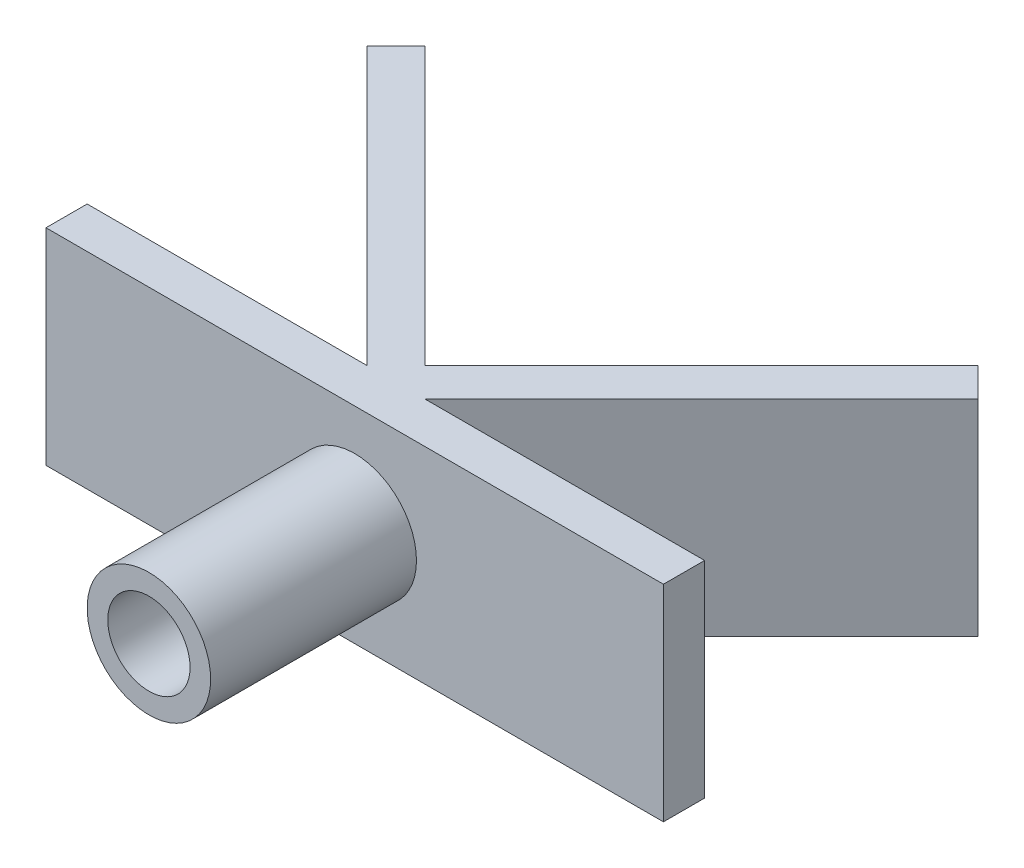
ISO-10303-21;
HEADER;
FILE_DESCRIPTION(('STEP AP214'),'2;1');
FILE_NAME('part.step','',(''),(''),'','','');
FILE_SCHEMA(('AUTOMOTIVE_DESIGN { 1 0 10303 214 1 1 1 1 }'));
ENDSEC;
DATA;
#1=APPLICATION_CONTEXT('core data for automotive mechanical design processes');
#2=APPLICATION_PROTOCOL_DEFINITION('international standard','automotive_design',2000,#1);
#3=PRODUCT_CONTEXT('',#1,'mechanical');
#4=PRODUCT('Part','Part','',(#3));
#5=PRODUCT_RELATED_PRODUCT_CATEGORY('part','',(#4));
#6=PRODUCT_DEFINITION_FORMATION('','',#4);
#7=PRODUCT_DEFINITION_CONTEXT('part definition',#1,'design');
#8=PRODUCT_DEFINITION('design','',#6,#7);
#9=PRODUCT_DEFINITION_SHAPE('','',#8);
#10=(LENGTH_UNIT() NAMED_UNIT(*) SI_UNIT(.MILLI.,.METRE.));
#11=(NAMED_UNIT(*) PLANE_ANGLE_UNIT() SI_UNIT($,.RADIAN.));
#12=(NAMED_UNIT(*) SI_UNIT($,.STERADIAN.) SOLID_ANGLE_UNIT());
#13=UNCERTAINTY_MEASURE_WITH_UNIT(LENGTH_MEASURE(1.E-05),#10,'distance_accuracy_value','');
#14=(GEOMETRIC_REPRESENTATION_CONTEXT(3) GLOBAL_UNCERTAINTY_ASSIGNED_CONTEXT((#13)) GLOBAL_UNIT_ASSIGNED_CONTEXT((#10,
#11,#12)) REPRESENTATION_CONTEXT('',''));
#15=CARTESIAN_POINT('',(0.,0.,0.));
#16=DIRECTION('',(0.,0.,1.));
#17=DIRECTION('',(1.,0.,0.));
#18=AXIS2_PLACEMENT_3D('',#15,#16,#17);
#19=CARTESIAN_POINT('',(0.,0.,-2.));
#20=DIRECTION('',(0.,0.,1.));
#21=DIRECTION('',(1.,0.,0.));
#22=AXIS2_PLACEMENT_3D('',#19,#20,#21);
#23=PLANE('',#22);
#24=DIRECTION('',(0.,1.,0.));
#25=VECTOR('',#24,1.);
#26=CARTESIAN_POINT('',(-1.4142135623731,-5.,-2.));
#27=LINE('',#26,#25);
#28=CARTESIAN_POINT('',(-1.4142135623731,-5.,-2.));
#29=VERTEX_POINT('',#28);
#30=CARTESIAN_POINT('',(-1.4142135623731,5.,-2.));
#31=VERTEX_POINT('',#30);
#32=EDGE_CURVE('E184',#29,#31,#27,.T.);
#33=ORIENTED_EDGE('',*,*,#32,.F.);
#34=DIRECTION('',(-1.,0.,0.));
#35=VECTOR('',#34,1.);
#36=CARTESIAN_POINT('',(0.,-5.,-2.));
#37=LINE('',#36,#35);
#38=CARTESIAN_POINT('',(-15.,-5.,-2.));
#39=VERTEX_POINT('',#38);
#40=EDGE_CURVE('E193',#29,#39,#37,.T.);
#41=ORIENTED_EDGE('',*,*,#40,.T.);
#42=DIRECTION('',(0.,1.,0.));
#43=VECTOR('',#42,1.);
#44=CARTESIAN_POINT('',(-15.,5.,-2.));
#45=LINE('',#44,#43);
#46=CARTESIAN_POINT('',(-15.,5.,-2.));
#47=VERTEX_POINT('',#46);
#48=EDGE_CURVE('E195',#39,#47,#45,.T.);
#49=ORIENTED_EDGE('',*,*,#48,.T.);
#50=DIRECTION('',(1.,0.,0.));
#51=VECTOR('',#50,1.);
#52=CARTESIAN_POINT('',(15.,5.,-2.));
#53=LINE('',#52,#51);
#54=EDGE_CURVE('E197',#47,#31,#53,.T.);
#55=ORIENTED_EDGE('',*,*,#54,.T.);
#56=EDGE_LOOP('',(#33,#41,#49,#55));
#57=FACE_BOUND('',#56,.T.);
#58=ADVANCED_FACE('F39',(#57),#23,.F.);
#59=CARTESIAN_POINT('',(0.,0.,10.));
#60=DIRECTION('',(0.,0.,1.));
#61=DIRECTION('',(1.,0.,0.));
#62=AXIS2_PLACEMENT_3D('',#59,#60,#61);
#63=PLANE('',#62);
#64=CARTESIAN_POINT('',(0.,0.,10.));
#65=DIRECTION('',(0.,0.,1.));
#66=DIRECTION('',(1.,0.,0.));
#67=AXIS2_PLACEMENT_3D('',#64,#65,#66);
#68=CIRCLE('',#67,3.);
#69=CARTESIAN_POINT('',(3.,0.,10.));
#70=VERTEX_POINT('',#69);
#71=EDGE_CURVE('E11',#70,#70,#68,.T.);
#72=ORIENTED_EDGE('',*,*,#71,.T.);
#73=EDGE_LOOP('',(#72));
#74=FACE_BOUND('',#73,.T.);
#75=CARTESIAN_POINT('',(0.,0.,10.));
#76=DIRECTION('',(0.,0.,1.));
#77=DIRECTION('',(1.,0.,0.));
#78=AXIS2_PLACEMENT_3D('',#75,#76,#77);
#79=CIRCLE('',#78,2.);
#80=CARTESIAN_POINT('',(2.,0.,10.));
#81=VERTEX_POINT('',#80);
#82=EDGE_CURVE('E48',#81,#81,#79,.T.);
#83=ORIENTED_EDGE('',*,*,#82,.F.);
#84=EDGE_LOOP('',(#83));
#85=FACE_BOUND('',#84,.T.);
#86=ADVANCED_FACE('F249',(#74,#85),#63,.T.);
#87=CARTESIAN_POINT('',(0.,0.,10.));
#88=DIRECTION('',(0.,0.,-1.));
#89=DIRECTION('',(-1.,0.,0.));
#90=AXIS2_PLACEMENT_3D('',#87,#88,#89);
#91=CYLINDRICAL_SURFACE('',#90,3.);
#92=ORIENTED_EDGE('',*,*,#71,.F.);
#93=EDGE_LOOP('',(#92));
#94=FACE_BOUND('',#93,.T.);
#95=CARTESIAN_POINT('',(0.,0.,0.));
#96=DIRECTION('',(0.,0.,1.));
#97=DIRECTION('',(1.,0.,0.));
#98=AXIS2_PLACEMENT_3D('',#95,#96,#97);
#99=CIRCLE('',#98,3.);
#100=CARTESIAN_POINT('',(3.,0.,0.));
#101=VERTEX_POINT('',#100);
#102=EDGE_CURVE('E43',#101,#101,#99,.T.);
#103=ORIENTED_EDGE('',*,*,#102,.T.);
#104=EDGE_LOOP('',(#103));
#105=FACE_BOUND('',#104,.T.);
#106=ADVANCED_FACE('F41',(#94,#105),#91,.T.);
#107=CARTESIAN_POINT('',(0.,0.,10.));
#108=DIRECTION('',(0.,0.,-1.));
#109=DIRECTION('',(-1.,0.,0.));
#110=AXIS2_PLACEMENT_3D('',#107,#108,#109);
#111=CYLINDRICAL_SURFACE('',#110,2.);
#112=ORIENTED_EDGE('',*,*,#82,.T.);
#113=EDGE_LOOP('',(#112));
#114=FACE_BOUND('',#113,.T.);
#115=CARTESIAN_POINT('',(0.,0.,0.));
#116=DIRECTION('',(0.,0.,1.));
#117=DIRECTION('',(1.,0.,0.));
#118=AXIS2_PLACEMENT_3D('',#115,#116,#117);
#119=CIRCLE('',#118,2.);
#120=CARTESIAN_POINT('',(2.,0.,0.));
#121=VERTEX_POINT('',#120);
#122=EDGE_CURVE('E218',#121,#121,#119,.T.);
#123=ORIENTED_EDGE('',*,*,#122,.F.);
#124=EDGE_LOOP('',(#123));
#125=FACE_BOUND('',#124,.T.);
#126=ADVANCED_FACE('F386',(#114,#125),#111,.F.);
#127=CARTESIAN_POINT('',(0.,0.,0.));
#128=DIRECTION('',(0.,0.,1.));
#129=DIRECTION('',(1.,0.,0.));
#130=AXIS2_PLACEMENT_3D('',#127,#128,#129);
#131=PLANE('',#130);
#132=ORIENTED_EDGE('',*,*,#122,.T.);
#133=EDGE_LOOP('',(#132));
#134=FACE_BOUND('',#133,.T.);
#135=ADVANCED_FACE('F231',(#134),#131,.T.);
#136=CARTESIAN_POINT('',(15.,-5.,-2.));
#137=DIRECTION('',(-1.,0.,0.));
#138=DIRECTION('',(0.,0.,1.));
#139=AXIS2_PLACEMENT_3D('',#136,#137,#138);
#140=PLANE('',#139);
#141=DIRECTION('',(0.,-1.,0.));
#142=VECTOR('',#141,1.);
#143=CARTESIAN_POINT('',(15.,-5.,0.));
#144=LINE('',#143,#142);
#145=CARTESIAN_POINT('',(15.,5.,0.));
#146=VERTEX_POINT('',#145);
#147=CARTESIAN_POINT('',(15.,-5.,0.));
#148=VERTEX_POINT('',#147);
#149=EDGE_CURVE('E181',#146,#148,#144,.T.);
#150=ORIENTED_EDGE('',*,*,#149,.T.);
#151=DIRECTION('',(0.,0.,1.));
#152=VECTOR('',#151,1.);
#153=CARTESIAN_POINT('',(15.,-5.,-2.));
#154=LINE('',#153,#152);
#155=CARTESIAN_POINT('',(15.,-5.,-2.));
#156=VERTEX_POINT('',#155);
#157=EDGE_CURVE('E214',#156,#148,#154,.T.);
#158=ORIENTED_EDGE('',*,*,#157,.F.);
#159=DIRECTION('',(0.,-1.,0.));
#160=VECTOR('',#159,1.);
#161=CARTESIAN_POINT('',(15.,-5.,-2.));
#162=LINE('',#161,#160);
#163=CARTESIAN_POINT('',(15.,5.,-2.));
#164=VERTEX_POINT('',#163);
#165=EDGE_CURVE('E191',#164,#156,#162,.T.);
#166=ORIENTED_EDGE('',*,*,#165,.F.);
#167=DIRECTION('',(0.,0.,1.));
#168=VECTOR('',#167,1.);
#169=CARTESIAN_POINT('',(15.,5.,-2.));
#170=LINE('',#169,#168);
#171=EDGE_CURVE('E200',#164,#146,#170,.T.);
#172=ORIENTED_EDGE('',*,*,#171,.T.);
#173=EDGE_LOOP('',(#150,#158,#166,#172));
#174=FACE_BOUND('',#173,.T.);
#175=ADVANCED_FACE('F236',(#174),#140,.F.);
#176=CARTESIAN_POINT('',(0.,-5.,-2.));
#177=DIRECTION('',(0.,1.,0.));
#178=DIRECTION('',(0.,0.,1.));
#179=AXIS2_PLACEMENT_3D('',#176,#177,#178);
#180=PLANE('',#179);
#181=DIRECTION('',(-1.,0.,0.));
#182=VECTOR('',#181,1.);
#183=CARTESIAN_POINT('',(0.,-5.,0.));
#184=LINE('',#183,#182);
#185=CARTESIAN_POINT('',(-15.,-5.,0.));
#186=VERTEX_POINT('',#185);
#187=EDGE_CURVE('E203',#148,#186,#184,.T.);
#188=ORIENTED_EDGE('',*,*,#187,.T.);
#189=DIRECTION('',(0.,0.,1.));
#190=VECTOR('',#189,1.);
#191=CARTESIAN_POINT('',(-15.,-5.,-2.));
#192=LINE('',#191,#190);
#193=EDGE_CURVE('E211',#39,#186,#192,.T.);
#194=ORIENTED_EDGE('',*,*,#193,.F.);
#195=ORIENTED_EDGE('',*,*,#40,.F.);
#196=DIRECTION('',(0.707106781186548,0.,0.707106781186548));
#197=VECTOR('',#196,1.);
#198=CARTESIAN_POINT('',(0.292893218813452,-5.,-0.292893218813452));
#199=LINE('',#198,#197);
#200=CARTESIAN_POINT('',(-14.8492424049175,-5.,-15.4350288425444));
#201=VERTEX_POINT('',#200);
#202=EDGE_CURVE('E164',#201,#29,#199,.T.);
#203=ORIENTED_EDGE('',*,*,#202,.F.);
#204=DIRECTION('',(-0.707106781186548,0.,0.707106781186547));
#205=VECTOR('',#204,1.);
#206=CARTESIAN_POINT('',(-15.1421356237309,-5.,-15.142135623731));
#207=LINE('',#206,#205);
#208=CARTESIAN_POINT('',(-13.4350288425444,-5.,-16.8492424049175));
#209=VERTEX_POINT('',#208);
#210=EDGE_CURVE('E159',#209,#201,#207,.T.);
#211=ORIENTED_EDGE('',*,*,#210,.F.);
#212=DIRECTION('',(0.707106781186548,0.,0.707106781186548));
#213=VECTOR('',#212,1.);
#214=CARTESIAN_POINT('',(1.70710678118655,-5.,-1.70710678118655));
#215=LINE('',#214,#213);
#216=CARTESIAN_POINT('',(0.,-5.,-3.41421356237308));
#217=VERTEX_POINT('',#216);
#218=EDGE_CURVE('E156',#209,#217,#215,.T.);
#219=ORIENTED_EDGE('',*,*,#218,.T.);
#220=DIRECTION('',(-0.707106781186547,0.,0.707106781186548));
#221=VECTOR('',#220,1.);
#222=CARTESIAN_POINT('',(-1.70710678118653,-5.,-1.70710678118653));
#223=LINE('',#222,#221);
#224=CARTESIAN_POINT('',(13.4350288425444,-5.,-16.8492424049175));
#225=VERTEX_POINT('',#224);
#226=EDGE_CURVE('E138',#225,#217,#223,.T.);
#227=ORIENTED_EDGE('',*,*,#226,.F.);
#228=DIRECTION('',(0.707106781186548,0.,0.707106781186547));
#229=VECTOR('',#228,1.);
#230=CARTESIAN_POINT('',(15.1421356237309,-5.,-15.142135623731));
#231=LINE('',#230,#229);
#232=CARTESIAN_POINT('',(14.8492424049175,-5.,-15.4350288425444));
#233=VERTEX_POINT('',#232);
#234=EDGE_CURVE('E149',#225,#233,#231,.T.);
#235=ORIENTED_EDGE('',*,*,#234,.T.);
#236=DIRECTION('',(-0.707106781186548,0.,0.707106781186548));
#237=VECTOR('',#236,1.);
#238=CARTESIAN_POINT('',(-0.292893218813453,-5.,-0.292893218813453));
#239=LINE('',#238,#237);
#240=CARTESIAN_POINT('',(1.41421356237309,-5.,-2.));
#241=VERTEX_POINT('',#240);
#242=EDGE_CURVE('E145',#233,#241,#239,.T.);
#243=ORIENTED_EDGE('',*,*,#242,.T.);
#244=EDGE_CURVE('E93',#156,#241,#37,.T.);
#245=ORIENTED_EDGE('',*,*,#244,.F.);
#246=ORIENTED_EDGE('',*,*,#157,.T.);
#247=EDGE_LOOP('',(#188,#194,#195,#203,#211,#219,#227,#235,#243,#245,#246));
#248=FACE_BOUND('',#247,.T.);
#249=ADVANCED_FACE('F153',(#248),#180,.F.);
#250=CARTESIAN_POINT('',(-15.,5.,-2.));
#251=DIRECTION('',(1.,0.,0.));
#252=DIRECTION('',(0.,0.,-1.));
#253=AXIS2_PLACEMENT_3D('',#250,#251,#252);
#254=PLANE('',#253);
#255=DIRECTION('',(0.,1.,0.));
#256=VECTOR('',#255,1.);
#257=CARTESIAN_POINT('',(-15.,5.,0.));
#258=LINE('',#257,#256);
#259=CARTESIAN_POINT('',(-15.,5.,0.));
#260=VERTEX_POINT('',#259);
#261=EDGE_CURVE('E205',#186,#260,#258,.T.);
#262=ORIENTED_EDGE('',*,*,#261,.T.);
#263=DIRECTION('',(0.,0.,1.));
#264=VECTOR('',#263,1.);
#265=CARTESIAN_POINT('',(-15.,5.,-2.));
#266=LINE('',#265,#264);
#267=EDGE_CURVE('E209',#47,#260,#266,.T.);
#268=ORIENTED_EDGE('',*,*,#267,.F.);
#269=ORIENTED_EDGE('',*,*,#48,.F.);
#270=ORIENTED_EDGE('',*,*,#193,.T.);
#271=EDGE_LOOP('',(#262,#268,#269,#270));
#272=FACE_BOUND('',#271,.T.);
#273=ADVANCED_FACE('F245',(#272),#254,.F.);
#274=CARTESIAN_POINT('',(15.,5.,-2.));
#275=DIRECTION('',(0.,-1.,0.));
#276=DIRECTION('',(0.,0.,-1.));
#277=AXIS2_PLACEMENT_3D('',#274,#275,#276);
#278=PLANE('',#277);
#279=DIRECTION('',(1.,0.,0.));
#280=VECTOR('',#279,1.);
#281=CARTESIAN_POINT('',(15.,5.,0.));
#282=LINE('',#281,#280);
#283=EDGE_CURVE('E85',#260,#146,#282,.T.);
#284=ORIENTED_EDGE('',*,*,#283,.T.);
#285=ORIENTED_EDGE('',*,*,#171,.F.);
#286=CARTESIAN_POINT('',(1.41421356237309,5.,-2.));
#287=VERTEX_POINT('',#286);
#288=EDGE_CURVE('E63',#287,#164,#53,.T.);
#289=ORIENTED_EDGE('',*,*,#288,.F.);
#290=DIRECTION('',(-0.707106781186548,0.,0.707106781186548));
#291=VECTOR('',#290,1.);
#292=CARTESIAN_POINT('',(-0.292893218813453,5.,-0.292893218813453));
#293=LINE('',#292,#291);
#294=CARTESIAN_POINT('',(14.8492424049175,5.,-15.4350288425444));
#295=VERTEX_POINT('',#294);
#296=EDGE_CURVE('E55',#295,#287,#293,.T.);
#297=ORIENTED_EDGE('',*,*,#296,.F.);
#298=DIRECTION('',(0.707106781186548,0.,0.707106781186547));
#299=VECTOR('',#298,1.);
#300=CARTESIAN_POINT('',(15.1421356237309,5.,-15.142135623731));
#301=LINE('',#300,#299);
#302=CARTESIAN_POINT('',(13.4350288425444,5.,-16.8492424049175));
#303=VERTEX_POINT('',#302);
#304=EDGE_CURVE('E167',#303,#295,#301,.T.);
#305=ORIENTED_EDGE('',*,*,#304,.F.);
#306=DIRECTION('',(-0.707106781186547,0.,0.707106781186548));
#307=VECTOR('',#306,1.);
#308=CARTESIAN_POINT('',(-1.70710678118653,5.,-1.70710678118653));
#309=LINE('',#308,#307);
#310=CARTESIAN_POINT('',(0.,5.,-3.41421356237308));
#311=VERTEX_POINT('',#310);
#312=EDGE_CURVE('E140',#303,#311,#309,.T.);
#313=ORIENTED_EDGE('',*,*,#312,.T.);
#314=DIRECTION('',(0.707106781186548,0.,0.707106781186548));
#315=VECTOR('',#314,1.);
#316=CARTESIAN_POINT('',(1.70710678118655,5.,-1.70710678118655));
#317=LINE('',#316,#315);
#318=CARTESIAN_POINT('',(-13.4350288425444,5.,-16.8492424049175));
#319=VERTEX_POINT('',#318);
#320=EDGE_CURVE('E170',#319,#311,#317,.T.);
#321=ORIENTED_EDGE('',*,*,#320,.F.);
#322=DIRECTION('',(-0.707106781186548,0.,0.707106781186547));
#323=VECTOR('',#322,1.);
#324=CARTESIAN_POINT('',(-15.1421356237309,5.,-15.142135623731));
#325=LINE('',#324,#323);
#326=CARTESIAN_POINT('',(-14.8492424049175,5.,-15.4350288425444));
#327=VERTEX_POINT('',#326);
#328=EDGE_CURVE('E173',#319,#327,#325,.T.);
#329=ORIENTED_EDGE('',*,*,#328,.T.);
#330=DIRECTION('',(0.707106781186548,0.,0.707106781186548));
#331=VECTOR('',#330,1.);
#332=CARTESIAN_POINT('',(0.292893218813452,5.,-0.292893218813452));
#333=LINE('',#332,#331);
#334=EDGE_CURVE('E176',#327,#31,#333,.T.);
#335=ORIENTED_EDGE('',*,*,#334,.T.);
#336=ORIENTED_EDGE('',*,*,#54,.F.);
#337=ORIENTED_EDGE('',*,*,#267,.T.);
#338=EDGE_LOOP('',(#284,#285,#289,#297,#305,#313,#321,#329,#335,#336,#337));
#339=FACE_BOUND('',#338,.T.);
#340=ADVANCED_FACE('F238',(#339),#278,.F.);
#341=ORIENTED_EDGE('',*,*,#244,.T.);
#342=DIRECTION('',(0.,1.,0.));
#343=VECTOR('',#342,1.);
#344=CARTESIAN_POINT('',(1.41421356237309,-5.,-2.));
#345=LINE('',#344,#343);
#346=EDGE_CURVE('E182',#241,#287,#345,.T.);
#347=ORIENTED_EDGE('',*,*,#346,.T.);
#348=ORIENTED_EDGE('',*,*,#288,.T.);
#349=ORIENTED_EDGE('',*,*,#165,.T.);
#350=EDGE_LOOP('',(#341,#347,#348,#349));
#351=FACE_BOUND('',#350,.T.);
#352=ADVANCED_FACE('F229',(#351),#23,.F.);
#353=ORIENTED_EDGE('',*,*,#102,.F.);
#354=EDGE_LOOP('',(#353));
#355=FACE_BOUND('',#354,.T.);
#356=ORIENTED_EDGE('',*,*,#149,.F.);
#357=ORIENTED_EDGE('',*,*,#283,.F.);
#358=ORIENTED_EDGE('',*,*,#261,.F.);
#359=ORIENTED_EDGE('',*,*,#187,.F.);
#360=EDGE_LOOP('',(#356,#357,#358,#359));
#361=FACE_BOUND('',#360,.T.);
#362=ADVANCED_FACE('F226',(#355,#361),#131,.T.);
#363=CARTESIAN_POINT('',(15.1421356237309,-5.,-15.142135623731));
#364=DIRECTION('',(-0.707106781186547,0.,0.707106781186548));
#365=DIRECTION('',(0.707106781186548,0.,0.707106781186547));
#366=AXIS2_PLACEMENT_3D('',#363,#364,#365);
#367=PLANE('',#366);
#368=ORIENTED_EDGE('',*,*,#304,.T.);
#369=DIRECTION('',(0.,1.,0.));
#370=VECTOR('',#369,1.);
#371=CARTESIAN_POINT('',(14.8492424049175,-5.,-15.4350288425444));
#372=LINE('',#371,#370);
#373=EDGE_CURVE('E151',#233,#295,#372,.T.);
#374=ORIENTED_EDGE('',*,*,#373,.F.);
#375=ORIENTED_EDGE('',*,*,#234,.F.);
#376=DIRECTION('',(0.,1.,0.));
#377=VECTOR('',#376,1.);
#378=CARTESIAN_POINT('',(13.4350288425444,-5.,-16.8492424049175));
#379=LINE('',#378,#377);
#380=EDGE_CURVE('E134',#225,#303,#379,.T.);
#381=ORIENTED_EDGE('',*,*,#380,.T.);
#382=EDGE_LOOP('',(#368,#374,#375,#381));
#383=FACE_BOUND('',#382,.T.);
#384=ADVANCED_FACE('F150',(#383),#367,.F.);
#385=CARTESIAN_POINT('',(-0.292893218813453,-5.,-0.292893218813453));
#386=DIRECTION('',(-0.707106781186548,0.,-0.707106781186548));
#387=DIRECTION('',(-0.707106781186548,0.,0.707106781186548));
#388=AXIS2_PLACEMENT_3D('',#385,#386,#387);
#389=PLANE('',#388);
#390=ORIENTED_EDGE('',*,*,#296,.T.);
#391=ORIENTED_EDGE('',*,*,#346,.F.);
#392=ORIENTED_EDGE('',*,*,#242,.F.);
#393=ORIENTED_EDGE('',*,*,#373,.T.);
#394=EDGE_LOOP('',(#390,#391,#392,#393));
#395=FACE_BOUND('',#394,.T.);
#396=ADVANCED_FACE('F239',(#395),#389,.F.);
#397=CARTESIAN_POINT('',(0.292893218813452,-5.,-0.292893218813452));
#398=DIRECTION('',(-0.707106781186548,0.,0.707106781186548));
#399=DIRECTION('',(0.707106781186548,0.,0.707106781186548));
#400=AXIS2_PLACEMENT_3D('',#397,#398,#399);
#401=PLANE('',#400);
#402=ORIENTED_EDGE('',*,*,#334,.F.);
#403=DIRECTION('',(0.,1.,0.));
#404=VECTOR('',#403,1.);
#405=CARTESIAN_POINT('',(-14.8492424049175,-5.,-15.4350288425444));
#406=LINE('',#405,#404);
#407=EDGE_CURVE('E186',#201,#327,#406,.T.);
#408=ORIENTED_EDGE('',*,*,#407,.F.);
#409=ORIENTED_EDGE('',*,*,#202,.T.);
#410=ORIENTED_EDGE('',*,*,#32,.T.);
#411=EDGE_LOOP('',(#402,#408,#409,#410));
#412=FACE_BOUND('',#411,.T.);
#413=ADVANCED_FACE('F267',(#412),#401,.T.);
#414=CARTESIAN_POINT('',(-15.1421356237309,-5.,-15.142135623731));
#415=DIRECTION('',(-0.707106781186547,0.,-0.707106781186548));
#416=DIRECTION('',(-0.707106781186548,0.,0.707106781186547));
#417=AXIS2_PLACEMENT_3D('',#414,#415,#416);
#418=PLANE('',#417);
#419=ORIENTED_EDGE('',*,*,#328,.F.);
#420=DIRECTION('',(0.,1.,0.));
#421=VECTOR('',#420,1.);
#422=CARTESIAN_POINT('',(-13.4350288425444,-5.,-16.8492424049175));
#423=LINE('',#422,#421);
#424=EDGE_CURVE('E188',#209,#319,#423,.T.);
#425=ORIENTED_EDGE('',*,*,#424,.F.);
#426=ORIENTED_EDGE('',*,*,#210,.T.);
#427=ORIENTED_EDGE('',*,*,#407,.T.);
#428=EDGE_LOOP('',(#419,#425,#426,#427));
#429=FACE_BOUND('',#428,.T.);
#430=ADVANCED_FACE('F269',(#429),#418,.T.);
#431=CARTESIAN_POINT('',(1.70710678118655,-5.,-1.70710678118655));
#432=DIRECTION('',(-0.707106781186548,0.,0.707106781186548));
#433=DIRECTION('',(0.707106781186548,0.,0.707106781186548));
#434=AXIS2_PLACEMENT_3D('',#431,#432,#433);
#435=PLANE('',#434);
#436=ORIENTED_EDGE('',*,*,#320,.T.);
#437=DIRECTION('',(0.,1.,0.));
#438=VECTOR('',#437,1.);
#439=CARTESIAN_POINT('',(0.,-5.,-3.41421356237308));
#440=LINE('',#439,#438);
#441=EDGE_CURVE('E144',#217,#311,#440,.T.);
#442=ORIENTED_EDGE('',*,*,#441,.F.);
#443=ORIENTED_EDGE('',*,*,#218,.F.);
#444=ORIENTED_EDGE('',*,*,#424,.T.);
#445=EDGE_LOOP('',(#436,#442,#443,#444));
#446=FACE_BOUND('',#445,.T.);
#447=ADVANCED_FACE('F271',(#446),#435,.F.);
#448=CARTESIAN_POINT('',(-1.70710678118653,-5.,-1.70710678118653));
#449=DIRECTION('',(-0.707106781186548,0.,-0.707106781186547));
#450=DIRECTION('',(-0.707106781186547,0.,0.707106781186548));
#451=AXIS2_PLACEMENT_3D('',#448,#449,#450);
#452=PLANE('',#451);
#453=ORIENTED_EDGE('',*,*,#312,.F.);
#454=ORIENTED_EDGE('',*,*,#380,.F.);
#455=ORIENTED_EDGE('',*,*,#226,.T.);
#456=ORIENTED_EDGE('',*,*,#441,.T.);
#457=EDGE_LOOP('',(#453,#454,#455,#456));
#458=FACE_BOUND('',#457,.T.);
#459=ADVANCED_FACE('F136',(#458),#452,.T.);
#460=CLOSED_SHELL('',(#58,#86,#106,#126,#135,#175,#249,#273,#340,#352,#362,#384,#396,#413,#430,
#447,#459));
#461=MANIFOLD_SOLID_BREP('B2',#460);
#462=ADVANCED_BREP_SHAPE_REPRESENTATION('',(#18,#461),#14);
#463=SHAPE_DEFINITION_REPRESENTATION(#9,#462);
ENDSEC;
END-ISO-10303-21;
